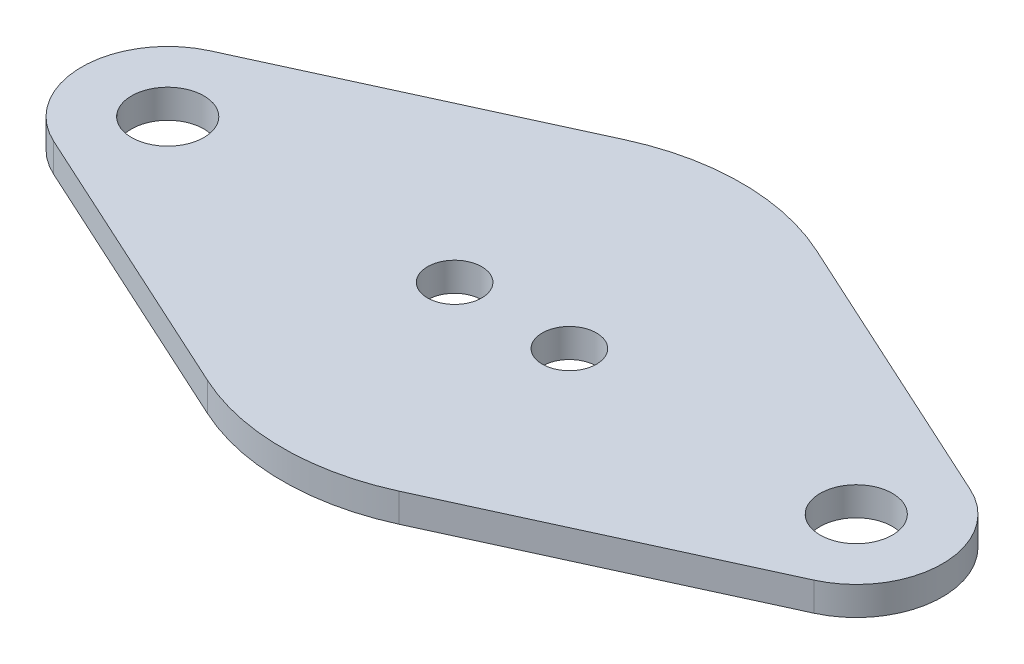
ISO-10303-21;
HEADER;
FILE_DESCRIPTION(('STEP AP214'),'2;1');
FILE_NAME('part.step','',(''),(''),'','','');
FILE_SCHEMA(('AUTOMOTIVE_DESIGN { 1 0 10303 214 1 1 1 1 }'));
ENDSEC;
DATA;
#1=APPLICATION_CONTEXT('core data for automotive mechanical design processes');
#2=APPLICATION_PROTOCOL_DEFINITION('international standard','automotive_design',2000,#1);
#3=PRODUCT_CONTEXT('',#1,'mechanical');
#4=PRODUCT('Part','Part','',(#3));
#5=PRODUCT_RELATED_PRODUCT_CATEGORY('part','',(#4));
#6=PRODUCT_DEFINITION_FORMATION('','',#4);
#7=PRODUCT_DEFINITION_CONTEXT('part definition',#1,'design');
#8=PRODUCT_DEFINITION('design','',#6,#7);
#9=PRODUCT_DEFINITION_SHAPE('','',#8);
#10=(LENGTH_UNIT() NAMED_UNIT(*) SI_UNIT(.MILLI.,.METRE.));
#11=(NAMED_UNIT(*) PLANE_ANGLE_UNIT() SI_UNIT($,.RADIAN.));
#12=(NAMED_UNIT(*) SI_UNIT($,.STERADIAN.) SOLID_ANGLE_UNIT());
#13=UNCERTAINTY_MEASURE_WITH_UNIT(LENGTH_MEASURE(1.E-05),#10,'distance_accuracy_value','');
#14=(GEOMETRIC_REPRESENTATION_CONTEXT(3) GLOBAL_UNCERTAINTY_ASSIGNED_CONTEXT((#13)) GLOBAL_UNIT_ASSIGNED_CONTEXT((#10,
#11,#12)) REPRESENTATION_CONTEXT('',''));
#15=CARTESIAN_POINT('',(0.,0.,0.));
#16=DIRECTION('',(0.,0.,1.));
#17=DIRECTION('',(1.,0.,0.));
#18=AXIS2_PLACEMENT_3D('',#15,#16,#17);
#19=CARTESIAN_POINT('',(-38.1,-3.175,0.));
#20=DIRECTION('',(0.,1.,0.));
#21=DIRECTION('',(0.,0.,1.));
#22=AXIS2_PLACEMENT_3D('',#19,#20,#21);
#23=CYLINDRICAL_SURFACE('',#22,9.525);
#24=CARTESIAN_POINT('',(-38.1,0.,0.));
#25=DIRECTION('',(0.,1.,0.));
#26=DIRECTION('',(0.,0.,1.));
#27=AXIS2_PLACEMENT_3D('',#24,#25,#26);
#28=CIRCLE('',#27,9.525);
#29=CARTESIAN_POINT('',(-42.06875,0.,-8.65879024099209));
#30=VERTEX_POINT('',#29);
#31=CARTESIAN_POINT('',(-42.06875,0.,8.6587902409921));
#32=VERTEX_POINT('',#31);
#33=EDGE_CURVE('E129',#30,#32,#28,.T.);
#34=ORIENTED_EDGE('',*,*,#33,.F.);
#35=DIRECTION('',(0.,1.,0.));
#36=VECTOR('',#35,1.);
#37=CARTESIAN_POINT('',(-42.06875,-3.175,-8.65879024099209));
#38=LINE('',#37,#36);
#39=CARTESIAN_POINT('',(-42.06875,-3.175,-8.65879024099209));
#40=VERTEX_POINT('',#39);
#41=EDGE_CURVE('E11',#40,#30,#38,.T.);
#42=ORIENTED_EDGE('',*,*,#41,.F.);
#43=CARTESIAN_POINT('',(-38.1,-3.175,0.));
#44=DIRECTION('',(0.,1.,0.));
#45=DIRECTION('',(0.,0.,1.));
#46=AXIS2_PLACEMENT_3D('',#43,#44,#45);
#47=CIRCLE('',#46,9.525);
#48=CARTESIAN_POINT('',(-42.06875,-3.175,8.6587902409921));
#49=VERTEX_POINT('',#48);
#50=EDGE_CURVE('E150',#40,#49,#47,.T.);
#51=ORIENTED_EDGE('',*,*,#50,.T.);
#52=DIRECTION('',(0.,1.,0.));
#53=VECTOR('',#52,1.);
#54=CARTESIAN_POINT('',(-42.06875,-3.175,8.6587902409921));
#55=LINE('',#54,#53);
#56=EDGE_CURVE('E35',#49,#32,#55,.T.);
#57=ORIENTED_EDGE('',*,*,#56,.T.);
#58=EDGE_LOOP('',(#34,#42,#51,#57));
#59=FACE_BOUND('',#58,.T.);
#60=ADVANCED_FACE('F32',(#59),#23,.T.);
#61=CARTESIAN_POINT('',(-42.06875,-3.175,-8.65879024099209));
#62=DIRECTION('',(-0.416666666666667,0.,-0.909059342886309));
#63=DIRECTION('',(-0.90905934288631,0.,0.416666666666667));
#64=AXIS2_PLACEMENT_3D('',#61,#62,#63);
#65=PLANE('',#64);
#66=DIRECTION('',(-0.90905934288631,0.,0.416666666666667));
#67=VECTOR('',#66,1.);
#68=CARTESIAN_POINT('',(-42.06875,0.,-8.65879024099209));
#69=LINE('',#68,#67);
#70=CARTESIAN_POINT('',(-10.5833333333333,0.,-23.0901073093123));
#71=VERTEX_POINT('',#70);
#72=EDGE_CURVE('E148',#71,#30,#69,.T.);
#73=ORIENTED_EDGE('',*,*,#72,.F.);
#74=DIRECTION('',(0.,1.,0.));
#75=VECTOR('',#74,1.);
#76=CARTESIAN_POINT('',(-10.5833333333333,-3.175,-23.0901073093123));
#77=LINE('',#76,#75);
#78=CARTESIAN_POINT('',(-10.5833333333333,-3.175,-23.0901073093123));
#79=VERTEX_POINT('',#78);
#80=EDGE_CURVE('E41',#79,#71,#77,.T.);
#81=ORIENTED_EDGE('',*,*,#80,.F.);
#82=DIRECTION('',(-0.90905934288631,0.,0.416666666666667));
#83=VECTOR('',#82,1.);
#84=CARTESIAN_POINT('',(-42.06875,-3.175,-8.65879024099209));
#85=LINE('',#84,#83);
#86=EDGE_CURVE('E119',#79,#40,#85,.T.);
#87=ORIENTED_EDGE('',*,*,#86,.T.);
#88=ORIENTED_EDGE('',*,*,#41,.T.);
#89=EDGE_LOOP('',(#73,#81,#87,#88));
#90=FACE_BOUND('',#89,.T.);
#91=ADVANCED_FACE('F162',(#90),#65,.T.);
#92=CARTESIAN_POINT('',(0.,-3.175,0.));
#93=DIRECTION('',(0.,1.,0.));
#94=DIRECTION('',(0.,0.,1.));
#95=AXIS2_PLACEMENT_3D('',#92,#93,#94);
#96=CYLINDRICAL_SURFACE('',#95,25.4);
#97=CARTESIAN_POINT('',(0.,0.,0.));
#98=DIRECTION('',(0.,1.,0.));
#99=DIRECTION('',(0.,0.,1.));
#100=AXIS2_PLACEMENT_3D('',#97,#98,#99);
#101=CIRCLE('',#100,25.4);
#102=CARTESIAN_POINT('',(10.5833333333333,0.,-23.0901073093123));
#103=VERTEX_POINT('',#102);
#104=EDGE_CURVE('E106',#103,#71,#101,.T.);
#105=ORIENTED_EDGE('',*,*,#104,.F.);
#106=DIRECTION('',(0.,1.,0.));
#107=VECTOR('',#106,1.);
#108=CARTESIAN_POINT('',(10.5833333333333,-3.175,-23.0901073093123));
#109=LINE('',#108,#107);
#110=CARTESIAN_POINT('',(10.5833333333333,-3.175,-23.0901073093123));
#111=VERTEX_POINT('',#110);
#112=EDGE_CURVE('E101',#111,#103,#109,.T.);
#113=ORIENTED_EDGE('',*,*,#112,.F.);
#114=CARTESIAN_POINT('',(0.,-3.175,0.));
#115=DIRECTION('',(0.,1.,0.));
#116=DIRECTION('',(0.,0.,1.));
#117=AXIS2_PLACEMENT_3D('',#114,#115,#116);
#118=CIRCLE('',#117,25.4);
#119=EDGE_CURVE('E104',#111,#79,#118,.T.);
#120=ORIENTED_EDGE('',*,*,#119,.T.);
#121=ORIENTED_EDGE('',*,*,#80,.T.);
#122=EDGE_LOOP('',(#105,#113,#120,#121));
#123=FACE_BOUND('',#122,.T.);
#124=ADVANCED_FACE('F103',(#123),#96,.T.);
#125=CARTESIAN_POINT('',(10.5833333333333,-3.175,-23.0901073093123));
#126=DIRECTION('',(0.416666666666667,0.,-0.90905934288631));
#127=DIRECTION('',(-0.90905934288631,0.,-0.416666666666667));
#128=AXIS2_PLACEMENT_3D('',#125,#126,#127);
#129=PLANE('',#128);
#130=DIRECTION('',(-0.909059342886309,0.,-0.416666666666666));
#131=VECTOR('',#130,1.);
#132=CARTESIAN_POINT('',(10.5833333333333,0.,-23.0901073093123));
#133=LINE('',#132,#131);
#134=CARTESIAN_POINT('',(42.06875,0.,-8.65879024099211));
#135=VERTEX_POINT('',#134);
#136=EDGE_CURVE('E145',#135,#103,#133,.T.);
#137=ORIENTED_EDGE('',*,*,#136,.F.);
#138=DIRECTION('',(0.,1.,0.));
#139=VECTOR('',#138,1.);
#140=CARTESIAN_POINT('',(42.06875,-3.175,-8.65879024099211));
#141=LINE('',#140,#139);
#142=CARTESIAN_POINT('',(42.06875,-3.175,-8.65879024099211));
#143=VERTEX_POINT('',#142);
#144=EDGE_CURVE('E111',#143,#135,#141,.T.);
#145=ORIENTED_EDGE('',*,*,#144,.F.);
#146=DIRECTION('',(-0.909059342886309,0.,-0.416666666666666));
#147=VECTOR('',#146,1.);
#148=CARTESIAN_POINT('',(10.5833333333333,-3.175,-23.0901073093123));
#149=LINE('',#148,#147);
#150=EDGE_CURVE('E117',#143,#111,#149,.T.);
#151=ORIENTED_EDGE('',*,*,#150,.T.);
#152=ORIENTED_EDGE('',*,*,#112,.T.);
#153=EDGE_LOOP('',(#137,#145,#151,#152));
#154=FACE_BOUND('',#153,.T.);
#155=ADVANCED_FACE('F121',(#154),#129,.T.);
#156=CARTESIAN_POINT('',(38.1,-3.175,0.));
#157=DIRECTION('',(0.,1.,0.));
#158=DIRECTION('',(0.,0.,1.));
#159=AXIS2_PLACEMENT_3D('',#156,#157,#158);
#160=CYLINDRICAL_SURFACE('',#159,9.525);
#161=CARTESIAN_POINT('',(38.1,0.,0.));
#162=DIRECTION('',(0.,1.,0.));
#163=DIRECTION('',(0.,0.,1.));
#164=AXIS2_PLACEMENT_3D('',#161,#162,#163);
#165=CIRCLE('',#164,9.525);
#166=CARTESIAN_POINT('',(42.06875,0.,8.6587902409921));
#167=VERTEX_POINT('',#166);
#168=EDGE_CURVE('E142',#167,#135,#165,.T.);
#169=ORIENTED_EDGE('',*,*,#168,.F.);
#170=DIRECTION('',(0.,1.,0.));
#171=VECTOR('',#170,1.);
#172=CARTESIAN_POINT('',(42.06875,-3.175,8.6587902409921));
#173=LINE('',#172,#171);
#174=CARTESIAN_POINT('',(42.06875,-3.175,8.6587902409921));
#175=VERTEX_POINT('',#174);
#176=EDGE_CURVE('E154',#175,#167,#173,.T.);
#177=ORIENTED_EDGE('',*,*,#176,.F.);
#178=CARTESIAN_POINT('',(38.1,-3.175,0.));
#179=DIRECTION('',(0.,1.,0.));
#180=DIRECTION('',(0.,0.,1.));
#181=AXIS2_PLACEMENT_3D('',#178,#179,#180);
#182=CIRCLE('',#181,9.525);
#183=EDGE_CURVE('E122',#175,#143,#182,.T.);
#184=ORIENTED_EDGE('',*,*,#183,.T.);
#185=ORIENTED_EDGE('',*,*,#144,.T.);
#186=EDGE_LOOP('',(#169,#177,#184,#185));
#187=FACE_BOUND('',#186,.T.);
#188=ADVANCED_FACE('F175',(#187),#160,.T.);
#189=CARTESIAN_POINT('',(42.06875,-3.175,8.6587902409921));
#190=DIRECTION('',(0.416666666666667,0.,0.90905934288631));
#191=DIRECTION('',(0.90905934288631,0.,-0.416666666666667));
#192=AXIS2_PLACEMENT_3D('',#189,#190,#191);
#193=PLANE('',#192);
#194=DIRECTION('',(0.909059342886309,0.,-0.416666666666667));
#195=VECTOR('',#194,1.);
#196=CARTESIAN_POINT('',(42.06875,0.,8.6587902409921));
#197=LINE('',#196,#195);
#198=CARTESIAN_POINT('',(10.5833333333333,0.,23.0901073093123));
#199=VERTEX_POINT('',#198);
#200=EDGE_CURVE('E139',#199,#167,#197,.T.);
#201=ORIENTED_EDGE('',*,*,#200,.F.);
#202=DIRECTION('',(0.,1.,0.));
#203=VECTOR('',#202,1.);
#204=CARTESIAN_POINT('',(10.5833333333333,-3.175,23.0901073093123));
#205=LINE('',#204,#203);
#206=CARTESIAN_POINT('',(10.5833333333333,-3.175,23.0901073093123));
#207=VERTEX_POINT('',#206);
#208=EDGE_CURVE('E156',#207,#199,#205,.T.);
#209=ORIENTED_EDGE('',*,*,#208,.F.);
#210=DIRECTION('',(0.909059342886309,0.,-0.416666666666667));
#211=VECTOR('',#210,1.);
#212=CARTESIAN_POINT('',(42.06875,-3.175,8.6587902409921));
#213=LINE('',#212,#211);
#214=EDGE_CURVE('E124',#207,#175,#213,.T.);
#215=ORIENTED_EDGE('',*,*,#214,.T.);
#216=ORIENTED_EDGE('',*,*,#176,.T.);
#217=EDGE_LOOP('',(#201,#209,#215,#216));
#218=FACE_BOUND('',#217,.T.);
#219=ADVANCED_FACE('F178',(#218),#193,.T.);
#220=CARTESIAN_POINT('',(0.,-3.175,0.));
#221=DIRECTION('',(0.,1.,0.));
#222=DIRECTION('',(0.,0.,1.));
#223=AXIS2_PLACEMENT_3D('',#220,#221,#222);
#224=CYLINDRICAL_SURFACE('',#223,25.4);
#225=CARTESIAN_POINT('',(0.,0.,0.));
#226=DIRECTION('',(0.,1.,0.));
#227=DIRECTION('',(0.,0.,1.));
#228=AXIS2_PLACEMENT_3D('',#225,#226,#227);
#229=CIRCLE('',#228,25.4);
#230=CARTESIAN_POINT('',(-10.5833333333334,0.,23.0901073093122));
#231=VERTEX_POINT('',#230);
#232=EDGE_CURVE('E136',#231,#199,#229,.T.);
#233=ORIENTED_EDGE('',*,*,#232,.F.);
#234=DIRECTION('',(0.,1.,0.));
#235=VECTOR('',#234,1.);
#236=CARTESIAN_POINT('',(-10.5833333333334,-3.175,23.0901073093122));
#237=LINE('',#236,#235);
#238=CARTESIAN_POINT('',(-10.5833333333334,-3.175,23.0901073093122));
#239=VERTEX_POINT('',#238);
#240=EDGE_CURVE('E157',#239,#231,#237,.T.);
#241=ORIENTED_EDGE('',*,*,#240,.F.);
#242=CARTESIAN_POINT('',(0.,-3.175,0.));
#243=DIRECTION('',(0.,1.,0.));
#244=DIRECTION('',(0.,0.,1.));
#245=AXIS2_PLACEMENT_3D('',#242,#243,#244);
#246=CIRCLE('',#245,25.4);
#247=EDGE_CURVE('E244',#239,#207,#246,.T.);
#248=ORIENTED_EDGE('',*,*,#247,.T.);
#249=ORIENTED_EDGE('',*,*,#208,.T.);
#250=EDGE_LOOP('',(#233,#241,#248,#249));
#251=FACE_BOUND('',#250,.T.);
#252=ADVANCED_FACE('F182',(#251),#224,.T.);
#253=CARTESIAN_POINT('',(-10.5833333333333,-3.175,23.0901073093122));
#254=DIRECTION('',(-0.416666666666666,0.,0.90905934288631));
#255=DIRECTION('',(0.90905934288631,0.,0.416666666666666));
#256=AXIS2_PLACEMENT_3D('',#253,#254,#255);
#257=PLANE('',#256);
#258=DIRECTION('',(0.90905934288631,0.,0.416666666666666));
#259=VECTOR('',#258,1.);
#260=CARTESIAN_POINT('',(-10.5833333333333,0.,23.0901073093122));
#261=LINE('',#260,#259);
#262=EDGE_CURVE('E132',#32,#231,#261,.T.);
#263=ORIENTED_EDGE('',*,*,#262,.F.);
#264=ORIENTED_EDGE('',*,*,#56,.F.);
#265=DIRECTION('',(0.90905934288631,0.,0.416666666666666));
#266=VECTOR('',#265,1.);
#267=CARTESIAN_POINT('',(-10.5833333333333,-3.175,23.0901073093122));
#268=LINE('',#267,#266);
#269=EDGE_CURVE('E242',#49,#239,#268,.T.);
#270=ORIENTED_EDGE('',*,*,#269,.T.);
#271=ORIENTED_EDGE('',*,*,#240,.T.);
#272=EDGE_LOOP('',(#263,#264,#270,#271));
#273=FACE_BOUND('',#272,.T.);
#274=ADVANCED_FACE('F159',(#273),#257,.T.);
#275=CARTESIAN_POINT('',(-38.1,-3.175,0.));
#276=DIRECTION('',(0.,1.,0.));
#277=DIRECTION('',(0.,0.,1.));
#278=AXIS2_PLACEMENT_3D('',#275,#276,#277);
#279=PLANE('',#278);
#280=CARTESIAN_POINT('',(-6.35,-3.175,0.));
#281=DIRECTION('',(0.,1.,0.));
#282=DIRECTION('',(0.,0.,1.));
#283=AXIS2_PLACEMENT_3D('',#280,#281,#282);
#284=CIRCLE('',#283,3.);
#285=CARTESIAN_POINT('',(-6.35,-3.175,3.));
#286=VERTEX_POINT('',#285);
#287=EDGE_CURVE('E217',#286,#286,#284,.T.);
#288=ORIENTED_EDGE('',*,*,#287,.T.);
#289=EDGE_LOOP('',(#288));
#290=FACE_BOUND('',#289,.T.);
#291=CARTESIAN_POINT('',(6.35,-3.175,0.));
#292=DIRECTION('',(0.,1.,0.));
#293=DIRECTION('',(0.,0.,1.));
#294=AXIS2_PLACEMENT_3D('',#291,#292,#293);
#295=CIRCLE('',#294,3.);
#296=CARTESIAN_POINT('',(6.35,-3.175,3.));
#297=VERTEX_POINT('',#296);
#298=EDGE_CURVE('E225',#297,#297,#295,.T.);
#299=ORIENTED_EDGE('',*,*,#298,.T.);
#300=EDGE_LOOP('',(#299));
#301=FACE_BOUND('',#300,.T.);
#302=CARTESIAN_POINT('',(38.1,-3.175,0.));
#303=DIRECTION('',(0.,1.,0.));
#304=DIRECTION('',(0.,0.,1.));
#305=AXIS2_PLACEMENT_3D('',#302,#303,#304);
#306=CIRCLE('',#305,4.);
#307=CARTESIAN_POINT('',(38.1,-3.175,4.));
#308=VERTEX_POINT('',#307);
#309=EDGE_CURVE('E231',#308,#308,#306,.T.);
#310=ORIENTED_EDGE('',*,*,#309,.T.);
#311=EDGE_LOOP('',(#310));
#312=FACE_BOUND('',#311,.T.);
#313=CARTESIAN_POINT('',(-38.1,-3.175,0.));
#314=DIRECTION('',(0.,1.,0.));
#315=DIRECTION('',(0.,0.,1.));
#316=AXIS2_PLACEMENT_3D('',#313,#314,#315);
#317=CIRCLE('',#316,4.00000000000001);
#318=CARTESIAN_POINT('',(-38.1,-3.175,4.00000000000001));
#319=VERTEX_POINT('',#318);
#320=EDGE_CURVE('E133',#319,#319,#317,.T.);
#321=ORIENTED_EDGE('',*,*,#320,.T.);
#322=EDGE_LOOP('',(#321));
#323=FACE_BOUND('',#322,.T.);
#324=ORIENTED_EDGE('',*,*,#50,.F.);
#325=ORIENTED_EDGE('',*,*,#86,.F.);
#326=ORIENTED_EDGE('',*,*,#119,.F.);
#327=ORIENTED_EDGE('',*,*,#150,.F.);
#328=ORIENTED_EDGE('',*,*,#183,.F.);
#329=ORIENTED_EDGE('',*,*,#214,.F.);
#330=ORIENTED_EDGE('',*,*,#247,.F.);
#331=ORIENTED_EDGE('',*,*,#269,.F.);
#332=EDGE_LOOP('',(#324,#325,#326,#327,#328,#329,#330,#331));
#333=FACE_BOUND('',#332,.T.);
#334=ADVANCED_FACE('F115',(#290,#301,#312,#323,#333),#279,.F.);
#335=CARTESIAN_POINT('',(-38.1,0.,0.));
#336=DIRECTION('',(0.,1.,0.));
#337=DIRECTION('',(0.,0.,1.));
#338=AXIS2_PLACEMENT_3D('',#335,#336,#337);
#339=PLANE('',#338);
#340=CARTESIAN_POINT('',(-6.35,0.,0.));
#341=DIRECTION('',(0.,1.,0.));
#342=DIRECTION('',(0.,0.,1.));
#343=AXIS2_PLACEMENT_3D('',#340,#341,#342);
#344=CIRCLE('',#343,3.);
#345=CARTESIAN_POINT('',(-6.35,0.,3.));
#346=VERTEX_POINT('',#345);
#347=EDGE_CURVE('E220',#346,#346,#344,.T.);
#348=ORIENTED_EDGE('',*,*,#347,.F.);
#349=EDGE_LOOP('',(#348));
#350=FACE_BOUND('',#349,.T.);
#351=CARTESIAN_POINT('',(6.35,0.,0.));
#352=DIRECTION('',(0.,1.,0.));
#353=DIRECTION('',(0.,0.,1.));
#354=AXIS2_PLACEMENT_3D('',#351,#352,#353);
#355=CIRCLE('',#354,3.);
#356=CARTESIAN_POINT('',(6.35,0.,3.));
#357=VERTEX_POINT('',#356);
#358=EDGE_CURVE('E222',#357,#357,#355,.T.);
#359=ORIENTED_EDGE('',*,*,#358,.F.);
#360=EDGE_LOOP('',(#359));
#361=FACE_BOUND('',#360,.T.);
#362=CARTESIAN_POINT('',(38.1,0.,0.));
#363=DIRECTION('',(0.,1.,0.));
#364=DIRECTION('',(0.,0.,1.));
#365=AXIS2_PLACEMENT_3D('',#362,#363,#364);
#366=CIRCLE('',#365,4.);
#367=CARTESIAN_POINT('',(38.1,0.,4.));
#368=VERTEX_POINT('',#367);
#369=EDGE_CURVE('E228',#368,#368,#366,.T.);
#370=ORIENTED_EDGE('',*,*,#369,.F.);
#371=EDGE_LOOP('',(#370));
#372=FACE_BOUND('',#371,.T.);
#373=CARTESIAN_POINT('',(-38.1,0.,0.));
#374=DIRECTION('',(0.,1.,0.));
#375=DIRECTION('',(0.,0.,1.));
#376=AXIS2_PLACEMENT_3D('',#373,#374,#375);
#377=CIRCLE('',#376,4.00000000000001);
#378=CARTESIAN_POINT('',(-38.1,0.,4.00000000000001));
#379=VERTEX_POINT('',#378);
#380=EDGE_CURVE('E234',#379,#379,#377,.T.);
#381=ORIENTED_EDGE('',*,*,#380,.F.);
#382=EDGE_LOOP('',(#381));
#383=FACE_BOUND('',#382,.T.);
#384=ORIENTED_EDGE('',*,*,#33,.T.);
#385=ORIENTED_EDGE('',*,*,#262,.T.);
#386=ORIENTED_EDGE('',*,*,#232,.T.);
#387=ORIENTED_EDGE('',*,*,#200,.T.);
#388=ORIENTED_EDGE('',*,*,#168,.T.);
#389=ORIENTED_EDGE('',*,*,#136,.T.);
#390=ORIENTED_EDGE('',*,*,#104,.T.);
#391=ORIENTED_EDGE('',*,*,#72,.T.);
#392=EDGE_LOOP('',(#384,#385,#386,#387,#388,#389,#390,#391));
#393=FACE_BOUND('',#392,.T.);
#394=ADVANCED_FACE('F161',(#350,#361,#372,#383,#393),#339,.T.);
#395=CARTESIAN_POINT('',(-38.1,-3.175,0.));
#396=DIRECTION('',(0.,1.,0.));
#397=DIRECTION('',(0.,0.,1.));
#398=AXIS2_PLACEMENT_3D('',#395,#396,#397);
#399=CYLINDRICAL_SURFACE('',#398,4.00000000000001);
#400=ORIENTED_EDGE('',*,*,#320,.F.);
#401=EDGE_LOOP('',(#400));
#402=FACE_BOUND('',#401,.T.);
#403=ORIENTED_EDGE('',*,*,#380,.T.);
#404=EDGE_LOOP('',(#403));
#405=FACE_BOUND('',#404,.T.);
#406=ADVANCED_FACE('F194',(#402,#405),#399,.F.);
#407=CARTESIAN_POINT('',(38.1,-3.175,0.));
#408=DIRECTION('',(0.,1.,0.));
#409=DIRECTION('',(0.,0.,1.));
#410=AXIS2_PLACEMENT_3D('',#407,#408,#409);
#411=CYLINDRICAL_SURFACE('',#410,4.);
#412=ORIENTED_EDGE('',*,*,#309,.F.);
#413=EDGE_LOOP('',(#412));
#414=FACE_BOUND('',#413,.T.);
#415=ORIENTED_EDGE('',*,*,#369,.T.);
#416=EDGE_LOOP('',(#415));
#417=FACE_BOUND('',#416,.T.);
#418=ADVANCED_FACE('F201',(#414,#417),#411,.F.);
#419=CARTESIAN_POINT('',(6.35,-3.175,0.));
#420=DIRECTION('',(0.,1.,0.));
#421=DIRECTION('',(0.,0.,1.));
#422=AXIS2_PLACEMENT_3D('',#419,#420,#421);
#423=CYLINDRICAL_SURFACE('',#422,3.);
#424=ORIENTED_EDGE('',*,*,#298,.F.);
#425=EDGE_LOOP('',(#424));
#426=FACE_BOUND('',#425,.T.);
#427=ORIENTED_EDGE('',*,*,#358,.T.);
#428=EDGE_LOOP('',(#427));
#429=FACE_BOUND('',#428,.T.);
#430=ADVANCED_FACE('F205',(#426,#429),#423,.F.);
#431=CARTESIAN_POINT('',(-6.35,-3.175,0.));
#432=DIRECTION('',(0.,1.,0.));
#433=DIRECTION('',(0.,0.,1.));
#434=AXIS2_PLACEMENT_3D('',#431,#432,#433);
#435=CYLINDRICAL_SURFACE('',#434,3.);
#436=ORIENTED_EDGE('',*,*,#287,.F.);
#437=EDGE_LOOP('',(#436));
#438=FACE_BOUND('',#437,.T.);
#439=ORIENTED_EDGE('',*,*,#347,.T.);
#440=EDGE_LOOP('',(#439));
#441=FACE_BOUND('',#440,.T.);
#442=ADVANCED_FACE('F209',(#438,#441),#435,.F.);
#443=CLOSED_SHELL('',(#60,#91,#124,#155,#188,#219,#252,#274,#334,#394,#406,#418,#430,#442));
#444=MANIFOLD_SOLID_BREP('B2',#443);
#445=ADVANCED_BREP_SHAPE_REPRESENTATION('',(#18,#444),#14);
#446=SHAPE_DEFINITION_REPRESENTATION(#9,#445);
ENDSEC;
END-ISO-10303-21;
